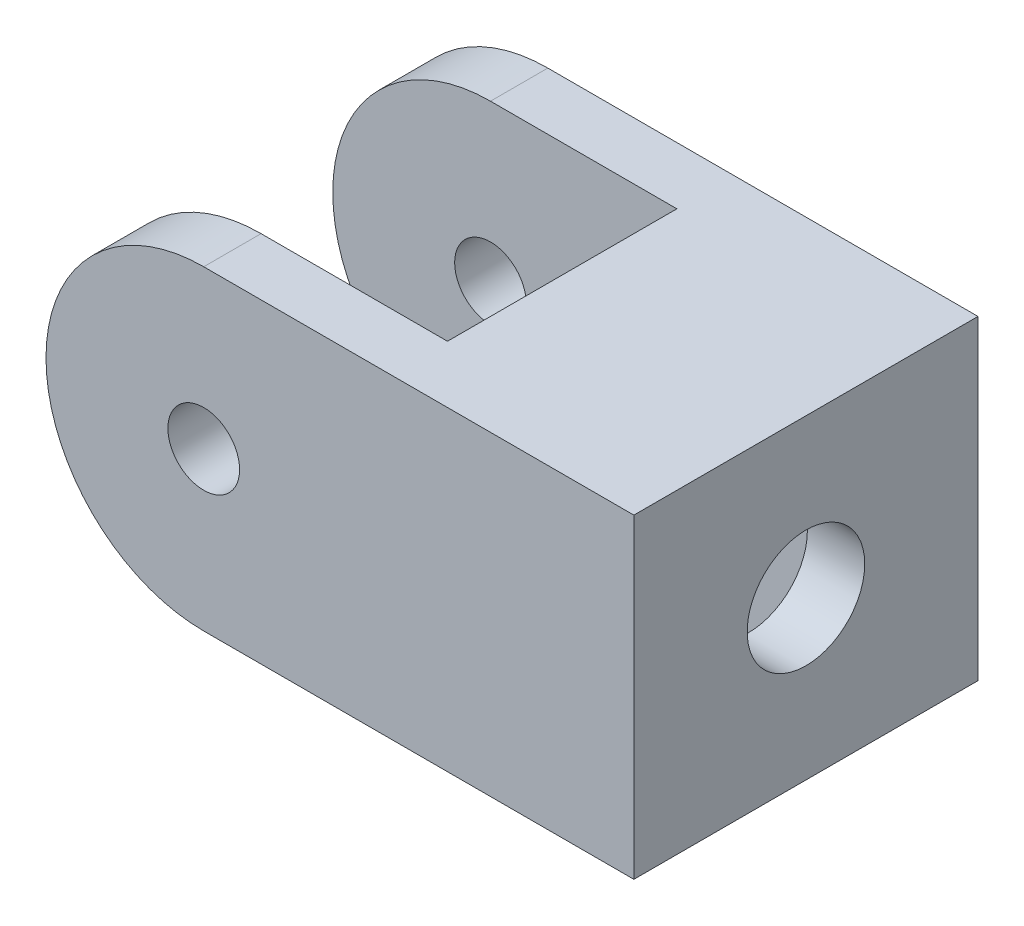
ISO-10303-21;
HEADER;
FILE_DESCRIPTION(('STEP AP214'),'2;1');
FILE_NAME('part.step','',(''),(''),'','','');
FILE_SCHEMA(('AUTOMOTIVE_DESIGN { 1 0 10303 214 1 1 1 1 }'));
ENDSEC;
DATA;
#1=APPLICATION_CONTEXT('core data for automotive mechanical design processes');
#2=APPLICATION_PROTOCOL_DEFINITION('international standard','automotive_design',2000,#1);
#3=PRODUCT_CONTEXT('',#1,'mechanical');
#4=PRODUCT('Part','Part','',(#3));
#5=PRODUCT_RELATED_PRODUCT_CATEGORY('part','',(#4));
#6=PRODUCT_DEFINITION_FORMATION('','',#4);
#7=PRODUCT_DEFINITION_CONTEXT('part definition',#1,'design');
#8=PRODUCT_DEFINITION('design','',#6,#7);
#9=PRODUCT_DEFINITION_SHAPE('','',#8);
#10=(LENGTH_UNIT() NAMED_UNIT(*) SI_UNIT(.MILLI.,.METRE.));
#11=(NAMED_UNIT(*) PLANE_ANGLE_UNIT() SI_UNIT($,.RADIAN.));
#12=(NAMED_UNIT(*) SI_UNIT($,.STERADIAN.) SOLID_ANGLE_UNIT());
#13=UNCERTAINTY_MEASURE_WITH_UNIT(LENGTH_MEASURE(1.E-05),#10,'distance_accuracy_value','');
#14=(GEOMETRIC_REPRESENTATION_CONTEXT(3) GLOBAL_UNCERTAINTY_ASSIGNED_CONTEXT((#13)) GLOBAL_UNIT_ASSIGNED_CONTEXT((#10,
#11,#12)) REPRESENTATION_CONTEXT('',''));
#15=CARTESIAN_POINT('',(0.,0.,0.));
#16=DIRECTION('',(0.,0.,1.));
#17=DIRECTION('',(1.,0.,0.));
#18=AXIS2_PLACEMENT_3D('',#15,#16,#17);
#19=CARTESIAN_POINT('',(30.,-11.,24.));
#20=DIRECTION('',(0.,1.,0.));
#21=DIRECTION('',(0.,0.,1.));
#22=AXIS2_PLACEMENT_3D('',#19,#20,#21);
#23=PLANE('',#22);
#24=DIRECTION('',(0.,0.,-1.));
#25=VECTOR('',#24,1.);
#26=CARTESIAN_POINT('',(13.,-11.,4.));
#27=LINE('',#26,#25);
#28=CARTESIAN_POINT('',(13.,-11.,20.));
#29=VERTEX_POINT('',#28);
#30=CARTESIAN_POINT('',(13.,-11.,4.));
#31=VERTEX_POINT('',#30);
#32=EDGE_CURVE('E163',#29,#31,#27,.T.);
#33=ORIENTED_EDGE('',*,*,#32,.T.);
#34=DIRECTION('',(-1.,0.,0.));
#35=VECTOR('',#34,1.);
#36=CARTESIAN_POINT('',(-11.,-11.,4.));
#37=LINE('',#36,#35);
#38=CARTESIAN_POINT('',(0.,-11.,4.));
#39=VERTEX_POINT('',#38);
#40=EDGE_CURVE('E167',#31,#39,#37,.T.);
#41=ORIENTED_EDGE('',*,*,#40,.T.);
#42=DIRECTION('',(0.,0.,-1.));
#43=VECTOR('',#42,1.);
#44=CARTESIAN_POINT('',(0.,-11.,24.));
#45=LINE('',#44,#43);
#46=CARTESIAN_POINT('',(0.,-11.,0.));
#47=VERTEX_POINT('',#46);
#48=EDGE_CURVE('E41',#39,#47,#45,.T.);
#49=ORIENTED_EDGE('',*,*,#48,.T.);
#50=DIRECTION('',(1.,0.,0.));
#51=VECTOR('',#50,1.);
#52=CARTESIAN_POINT('',(30.,-11.,0.));
#53=LINE('',#52,#51);
#54=CARTESIAN_POINT('',(30.,-11.,0.));
#55=VERTEX_POINT('',#54);
#56=EDGE_CURVE('E208',#47,#55,#53,.T.);
#57=ORIENTED_EDGE('',*,*,#56,.T.);
#58=DIRECTION('',(0.,0.,-1.));
#59=VECTOR('',#58,1.);
#60=CARTESIAN_POINT('',(30.,-11.,24.));
#61=LINE('',#60,#59);
#62=CARTESIAN_POINT('',(30.,-11.,24.));
#63=VERTEX_POINT('',#62);
#64=EDGE_CURVE('E220',#63,#55,#61,.T.);
#65=ORIENTED_EDGE('',*,*,#64,.F.);
#66=DIRECTION('',(1.,0.,0.));
#67=VECTOR('',#66,1.);
#68=CARTESIAN_POINT('',(30.,-11.,24.));
#69=LINE('',#68,#67);
#70=CARTESIAN_POINT('',(0.,-11.,24.));
#71=VERTEX_POINT('',#70);
#72=EDGE_CURVE('E198',#71,#63,#69,.T.);
#73=ORIENTED_EDGE('',*,*,#72,.F.);
#74=CARTESIAN_POINT('',(0.,-11.,20.));
#75=VERTEX_POINT('',#74);
#76=EDGE_CURVE('E11',#71,#75,#45,.T.);
#77=ORIENTED_EDGE('',*,*,#76,.T.);
#78=DIRECTION('',(1.,0.,0.));
#79=VECTOR('',#78,1.);
#80=CARTESIAN_POINT('',(-11.,-11.,20.));
#81=LINE('',#80,#79);
#82=EDGE_CURVE('E160',#75,#29,#81,.T.);
#83=ORIENTED_EDGE('',*,*,#82,.T.);
#84=EDGE_LOOP('',(#33,#41,#49,#57,#65,#73,#77,#83));
#85=FACE_BOUND('',#84,.T.);
#86=DIRECTION('',(0.,0.,-1.));
#87=VECTOR('',#86,1.);
#88=CARTESIAN_POINT('',(19.2,-11.,0.));
#89=LINE('',#88,#87);
#90=CARTESIAN_POINT('',(19.2,-11.,18.5));
#91=VERTEX_POINT('',#90);
#92=CARTESIAN_POINT('',(19.2,-11.,5.5));
#93=VERTEX_POINT('',#92);
#94=EDGE_CURVE('E140',#91,#93,#89,.T.);
#95=ORIENTED_EDGE('',*,*,#94,.F.);
#96=DIRECTION('',(1.,0.,0.));
#97=VECTOR('',#96,1.);
#98=CARTESIAN_POINT('',(19.2,-11.,18.5));
#99=LINE('',#98,#97);
#100=CARTESIAN_POINT('',(26.,-11.,18.5));
#101=VERTEX_POINT('',#100);
#102=EDGE_CURVE('E174',#91,#101,#99,.T.);
#103=ORIENTED_EDGE('',*,*,#102,.T.);
#104=DIRECTION('',(0.,0.,-1.));
#105=VECTOR('',#104,1.);
#106=CARTESIAN_POINT('',(26.,-11.,0.));
#107=LINE('',#106,#105);
#108=CARTESIAN_POINT('',(26.,-11.,5.5));
#109=VERTEX_POINT('',#108);
#110=EDGE_CURVE('E152',#101,#109,#107,.T.);
#111=ORIENTED_EDGE('',*,*,#110,.T.);
#112=DIRECTION('',(1.,0.,0.));
#113=VECTOR('',#112,1.);
#114=CARTESIAN_POINT('',(19.2,-11.,5.5));
#115=LINE('',#114,#113);
#116=EDGE_CURVE('E133',#93,#109,#115,.T.);
#117=ORIENTED_EDGE('',*,*,#116,.F.);
#118=EDGE_LOOP('',(#95,#103,#111,#117));
#119=FACE_BOUND('',#118,.T.);
#120=ADVANCED_FACE('F32',(#85,#119),#23,.F.);
#121=CARTESIAN_POINT('',(0.,0.,24.));
#122=DIRECTION('',(0.,0.,-1.));
#123=DIRECTION('',(-1.,0.,0.));
#124=AXIS2_PLACEMENT_3D('',#121,#122,#123);
#125=CYLINDRICAL_SURFACE('',#124,11.);
#126=CARTESIAN_POINT('',(0.,0.,4.));
#127=DIRECTION('',(0.,0.,-1.));
#128=DIRECTION('',(-1.,0.,0.));
#129=AXIS2_PLACEMENT_3D('',#126,#127,#128);
#130=CIRCLE('',#129,11.);
#131=CARTESIAN_POINT('',(0.,11.,4.));
#132=VERTEX_POINT('',#131);
#133=EDGE_CURVE('E186',#39,#132,#130,.T.);
#134=ORIENTED_EDGE('',*,*,#133,.T.);
#135=DIRECTION('',(0.,0.,-1.));
#136=VECTOR('',#135,1.);
#137=CARTESIAN_POINT('',(0.,11.,24.));
#138=LINE('',#137,#136);
#139=CARTESIAN_POINT('',(0.,11.,0.));
#140=VERTEX_POINT('',#139);
#141=EDGE_CURVE('E205',#132,#140,#138,.T.);
#142=ORIENTED_EDGE('',*,*,#141,.T.);
#143=CARTESIAN_POINT('',(0.,0.,0.));
#144=DIRECTION('',(0.,0.,1.));
#145=DIRECTION('',(1.,0.,0.));
#146=AXIS2_PLACEMENT_3D('',#143,#144,#145);
#147=CIRCLE('',#146,11.);
#148=EDGE_CURVE('E192',#140,#47,#147,.T.);
#149=ORIENTED_EDGE('',*,*,#148,.T.);
#150=ORIENTED_EDGE('',*,*,#48,.F.);
#151=EDGE_LOOP('',(#134,#142,#149,#150));
#152=FACE_BOUND('',#151,.T.);
#153=ADVANCED_FACE('F234',(#152),#125,.T.);
#154=CARTESIAN_POINT('',(0.,0.,24.));
#155=DIRECTION('',(0.,0.,-1.));
#156=DIRECTION('',(-1.,0.,0.));
#157=AXIS2_PLACEMENT_3D('',#154,#155,#156);
#158=CYLINDRICAL_SURFACE('',#157,2.5);
#159=CARTESIAN_POINT('',(0.,0.,4.));
#160=DIRECTION('',(0.,0.,-1.));
#161=DIRECTION('',(-1.,0.,0.));
#162=AXIS2_PLACEMENT_3D('',#159,#160,#161);
#163=CIRCLE('',#162,2.5);
#164=CARTESIAN_POINT('',(-2.5,0.,4.));
#165=VERTEX_POINT('',#164);
#166=EDGE_CURVE('E185',#165,#165,#163,.T.);
#167=ORIENTED_EDGE('',*,*,#166,.F.);
#168=EDGE_LOOP('',(#167));
#169=FACE_BOUND('',#168,.T.);
#170=CARTESIAN_POINT('',(0.,0.,0.));
#171=DIRECTION('',(0.,0.,1.));
#172=DIRECTION('',(1.,0.,0.));
#173=AXIS2_PLACEMENT_3D('',#170,#171,#172);
#174=CIRCLE('',#173,2.5);
#175=CARTESIAN_POINT('',(2.5,0.,0.));
#176=VERTEX_POINT('',#175);
#177=EDGE_CURVE('E188',#176,#176,#174,.T.);
#178=ORIENTED_EDGE('',*,*,#177,.F.);
#179=EDGE_LOOP('',(#178));
#180=FACE_BOUND('',#179,.T.);
#181=ADVANCED_FACE('F230',(#169,#180),#158,.F.);
#182=CARTESIAN_POINT('',(0.,0.,24.));
#183=DIRECTION('',(0.,0.,1.));
#184=DIRECTION('',(1.,0.,0.));
#185=AXIS2_PLACEMENT_3D('',#182,#183,#184);
#186=PLANE('',#185);
#187=CARTESIAN_POINT('',(0.,0.,24.));
#188=DIRECTION('',(0.,0.,1.));
#189=DIRECTION('',(1.,0.,0.));
#190=AXIS2_PLACEMENT_3D('',#187,#188,#189);
#191=CIRCLE('',#190,11.);
#192=CARTESIAN_POINT('',(0.,11.,24.));
#193=VERTEX_POINT('',#192);
#194=EDGE_CURVE('E195',#193,#71,#191,.T.);
#195=ORIENTED_EDGE('',*,*,#194,.T.);
#196=ORIENTED_EDGE('',*,*,#72,.T.);
#197=DIRECTION('',(0.,1.,0.));
#198=VECTOR('',#197,1.);
#199=CARTESIAN_POINT('',(30.,11.,24.));
#200=LINE('',#199,#198);
#201=CARTESIAN_POINT('',(30.,11.,24.));
#202=VERTEX_POINT('',#201);
#203=EDGE_CURVE('E201',#63,#202,#200,.T.);
#204=ORIENTED_EDGE('',*,*,#203,.T.);
#205=DIRECTION('',(-1.,0.,0.));
#206=VECTOR('',#205,1.);
#207=CARTESIAN_POINT('',(0.,11.,24.));
#208=LINE('',#207,#206);
#209=EDGE_CURVE('E203',#202,#193,#208,.T.);
#210=ORIENTED_EDGE('',*,*,#209,.T.);
#211=EDGE_LOOP('',(#195,#196,#204,#210));
#212=FACE_BOUND('',#211,.T.);
#213=CARTESIAN_POINT('',(0.,0.,24.));
#214=DIRECTION('',(0.,0.,1.));
#215=DIRECTION('',(1.,0.,0.));
#216=AXIS2_PLACEMENT_3D('',#213,#214,#215);
#217=CIRCLE('',#216,2.5);
#218=CARTESIAN_POINT('',(2.5,0.,24.));
#219=VERTEX_POINT('',#218);
#220=EDGE_CURVE('E189',#219,#219,#217,.T.);
#221=ORIENTED_EDGE('',*,*,#220,.F.);
#222=EDGE_LOOP('',(#221));
#223=FACE_BOUND('',#222,.T.);
#224=ADVANCED_FACE('F233',(#212,#223),#186,.T.);
#225=CARTESIAN_POINT('',(0.,0.,0.));
#226=DIRECTION('',(0.,0.,1.));
#227=DIRECTION('',(1.,0.,0.));
#228=AXIS2_PLACEMENT_3D('',#225,#226,#227);
#229=PLANE('',#228);
#230=ORIENTED_EDGE('',*,*,#148,.F.);
#231=DIRECTION('',(-1.,0.,0.));
#232=VECTOR('',#231,1.);
#233=CARTESIAN_POINT('',(0.,11.,0.));
#234=LINE('',#233,#232);
#235=CARTESIAN_POINT('',(30.,11.,0.));
#236=VERTEX_POINT('',#235);
#237=EDGE_CURVE('E199',#236,#140,#234,.T.);
#238=ORIENTED_EDGE('',*,*,#237,.F.);
#239=DIRECTION('',(0.,1.,0.));
#240=VECTOR('',#239,1.);
#241=CARTESIAN_POINT('',(30.,11.,0.));
#242=LINE('',#241,#240);
#243=EDGE_CURVE('E210',#55,#236,#242,.T.);
#244=ORIENTED_EDGE('',*,*,#243,.F.);
#245=ORIENTED_EDGE('',*,*,#56,.F.);
#246=EDGE_LOOP('',(#230,#238,#244,#245));
#247=FACE_BOUND('',#246,.T.);
#248=ORIENTED_EDGE('',*,*,#177,.T.);
#249=EDGE_LOOP('',(#248));
#250=FACE_BOUND('',#249,.T.);
#251=ADVANCED_FACE('F239',(#247,#250),#229,.F.);
#252=CARTESIAN_POINT('',(0.,11.,20.));
#253=VERTEX_POINT('',#252);
#254=EDGE_CURVE('E214',#193,#253,#138,.T.);
#255=ORIENTED_EDGE('',*,*,#254,.T.);
#256=CARTESIAN_POINT('',(0.,0.,20.));
#257=DIRECTION('',(0.,0.,1.));
#258=DIRECTION('',(1.,0.,0.));
#259=AXIS2_PLACEMENT_3D('',#256,#257,#258);
#260=CIRCLE('',#259,11.);
#261=EDGE_CURVE('E57',#253,#75,#260,.T.);
#262=ORIENTED_EDGE('',*,*,#261,.T.);
#263=ORIENTED_EDGE('',*,*,#76,.F.);
#264=ORIENTED_EDGE('',*,*,#194,.F.);
#265=EDGE_LOOP('',(#255,#262,#263,#264));
#266=FACE_BOUND('',#265,.T.);
#267=ADVANCED_FACE('F34',(#266),#125,.T.);
#268=CARTESIAN_POINT('',(30.,11.,24.));
#269=DIRECTION('',(-1.,0.,0.));
#270=DIRECTION('',(0.,0.,1.));
#271=AXIS2_PLACEMENT_3D('',#268,#269,#270);
#272=PLANE('',#271);
#273=CARTESIAN_POINT('',(30.,0.,12.));
#274=DIRECTION('',(1.,0.,0.));
#275=DIRECTION('',(0.,0.,-1.));
#276=AXIS2_PLACEMENT_3D('',#273,#274,#275);
#277=CIRCLE('',#276,4.1);
#278=CARTESIAN_POINT('',(30.,0.,7.9));
#279=VERTEX_POINT('',#278);
#280=EDGE_CURVE('E337',#279,#279,#277,.T.);
#281=ORIENTED_EDGE('',*,*,#280,.F.);
#282=EDGE_LOOP('',(#281));
#283=FACE_BOUND('',#282,.T.);
#284=ORIENTED_EDGE('',*,*,#243,.T.);
#285=DIRECTION('',(0.,0.,-1.));
#286=VECTOR('',#285,1.);
#287=CARTESIAN_POINT('',(30.,11.,24.));
#288=LINE('',#287,#286);
#289=EDGE_CURVE('E217',#202,#236,#288,.T.);
#290=ORIENTED_EDGE('',*,*,#289,.F.);
#291=ORIENTED_EDGE('',*,*,#203,.F.);
#292=ORIENTED_EDGE('',*,*,#64,.T.);
#293=EDGE_LOOP('',(#284,#290,#291,#292));
#294=FACE_BOUND('',#293,.T.);
#295=ADVANCED_FACE('F247',(#283,#294),#272,.F.);
#296=CARTESIAN_POINT('',(0.,11.,24.));
#297=DIRECTION('',(0.,-1.,0.));
#298=DIRECTION('',(0.,0.,-1.));
#299=AXIS2_PLACEMENT_3D('',#296,#297,#298);
#300=PLANE('',#299);
#301=ORIENTED_EDGE('',*,*,#141,.F.);
#302=DIRECTION('',(-1.,0.,0.));
#303=VECTOR('',#302,1.);
#304=CARTESIAN_POINT('',(-11.,11.,4.));
#305=LINE('',#304,#303);
#306=CARTESIAN_POINT('',(13.,11.,4.));
#307=VERTEX_POINT('',#306);
#308=EDGE_CURVE('E164',#307,#132,#305,.T.);
#309=ORIENTED_EDGE('',*,*,#308,.F.);
#310=DIRECTION('',(0.,0.,-1.));
#311=VECTOR('',#310,1.);
#312=CARTESIAN_POINT('',(13.,11.,4.));
#313=LINE('',#312,#311);
#314=CARTESIAN_POINT('',(13.,11.,20.));
#315=VERTEX_POINT('',#314);
#316=EDGE_CURVE('E173',#315,#307,#313,.T.);
#317=ORIENTED_EDGE('',*,*,#316,.F.);
#318=DIRECTION('',(1.,0.,0.));
#319=VECTOR('',#318,1.);
#320=CARTESIAN_POINT('',(-11.,11.,20.));
#321=LINE('',#320,#319);
#322=EDGE_CURVE('E171',#253,#315,#321,.T.);
#323=ORIENTED_EDGE('',*,*,#322,.F.);
#324=ORIENTED_EDGE('',*,*,#254,.F.);
#325=ORIENTED_EDGE('',*,*,#209,.F.);
#326=ORIENTED_EDGE('',*,*,#289,.T.);
#327=ORIENTED_EDGE('',*,*,#237,.T.);
#328=EDGE_LOOP('',(#301,#309,#317,#323,#324,#325,#326,#327));
#329=FACE_BOUND('',#328,.T.);
#330=ADVANCED_FACE('F261',(#329),#300,.F.);
#331=CARTESIAN_POINT('',(0.,0.,20.));
#332=DIRECTION('',(0.,0.,1.));
#333=DIRECTION('',(1.,0.,0.));
#334=AXIS2_PLACEMENT_3D('',#331,#332,#333);
#335=CIRCLE('',#334,2.5);
#336=CARTESIAN_POINT('',(2.5,0.,20.));
#337=VERTEX_POINT('',#336);
#338=EDGE_CURVE('E181',#337,#337,#335,.T.);
#339=ORIENTED_EDGE('',*,*,#338,.F.);
#340=EDGE_LOOP('',(#339));
#341=FACE_BOUND('',#340,.T.);
#342=ORIENTED_EDGE('',*,*,#220,.T.);
#343=EDGE_LOOP('',(#342));
#344=FACE_BOUND('',#343,.T.);
#345=ADVANCED_FACE('F236',(#341,#344),#158,.F.);
#346=CARTESIAN_POINT('',(-11.,-11.,4.));
#347=DIRECTION('',(0.,0.,-1.));
#348=DIRECTION('',(-1.,0.,0.));
#349=AXIS2_PLACEMENT_3D('',#346,#347,#348);
#350=PLANE('',#349);
#351=ORIENTED_EDGE('',*,*,#166,.T.);
#352=EDGE_LOOP('',(#351));
#353=FACE_BOUND('',#352,.T.);
#354=ORIENTED_EDGE('',*,*,#133,.F.);
#355=ORIENTED_EDGE('',*,*,#40,.F.);
#356=DIRECTION('',(0.,1.,0.));
#357=VECTOR('',#356,1.);
#358=CARTESIAN_POINT('',(13.,-11.,4.));
#359=LINE('',#358,#357);
#360=EDGE_CURVE('E179',#31,#307,#359,.T.);
#361=ORIENTED_EDGE('',*,*,#360,.T.);
#362=ORIENTED_EDGE('',*,*,#308,.T.);
#363=EDGE_LOOP('',(#354,#355,#361,#362));
#364=FACE_BOUND('',#363,.T.);
#365=ADVANCED_FACE('F227',(#353,#364),#350,.F.);
#366=CARTESIAN_POINT('',(-11.,-11.,20.));
#367=DIRECTION('',(0.,0.,1.));
#368=DIRECTION('',(1.,0.,0.));
#369=AXIS2_PLACEMENT_3D('',#366,#367,#368);
#370=PLANE('',#369);
#371=ORIENTED_EDGE('',*,*,#338,.T.);
#372=EDGE_LOOP('',(#371));
#373=FACE_BOUND('',#372,.T.);
#374=ORIENTED_EDGE('',*,*,#322,.T.);
#375=DIRECTION('',(0.,1.,0.));
#376=VECTOR('',#375,1.);
#377=CARTESIAN_POINT('',(13.,-11.,20.));
#378=LINE('',#377,#376);
#379=EDGE_CURVE('E170',#29,#315,#378,.T.);
#380=ORIENTED_EDGE('',*,*,#379,.F.);
#381=ORIENTED_EDGE('',*,*,#82,.F.);
#382=ORIENTED_EDGE('',*,*,#261,.F.);
#383=EDGE_LOOP('',(#374,#380,#381,#382));
#384=FACE_BOUND('',#383,.T.);
#385=ADVANCED_FACE('F289',(#373,#384),#370,.F.);
#386=CARTESIAN_POINT('',(13.,-11.,4.));
#387=DIRECTION('',(1.,0.,0.));
#388=DIRECTION('',(0.,0.,-1.));
#389=AXIS2_PLACEMENT_3D('',#386,#387,#388);
#390=PLANE('',#389);
#391=CARTESIAN_POINT('',(13.,0.,12.));
#392=DIRECTION('',(1.,0.,0.));
#393=DIRECTION('',(0.,0.,-1.));
#394=AXIS2_PLACEMENT_3D('',#391,#392,#393);
#395=CIRCLE('',#394,4.1);
#396=CARTESIAN_POINT('',(13.,0.,7.9));
#397=VERTEX_POINT('',#396);
#398=EDGE_CURVE('E336',#397,#397,#395,.F.);
#399=ORIENTED_EDGE('',*,*,#398,.F.);
#400=EDGE_LOOP('',(#399));
#401=FACE_BOUND('',#400,.T.);
#402=ORIENTED_EDGE('',*,*,#316,.T.);
#403=ORIENTED_EDGE('',*,*,#360,.F.);
#404=ORIENTED_EDGE('',*,*,#32,.F.);
#405=ORIENTED_EDGE('',*,*,#379,.T.);
#406=EDGE_LOOP('',(#402,#403,#404,#405));
#407=FACE_BOUND('',#406,.T.);
#408=ADVANCED_FACE('F277',(#401,#407),#390,.F.);
#409=CARTESIAN_POINT('',(19.2,0.,18.5));
#410=DIRECTION('',(0.,0.,1.));
#411=DIRECTION('',(1.,0.,0.));
#412=AXIS2_PLACEMENT_3D('',#409,#410,#411);
#413=PLANE('',#412);
#414=DIRECTION('',(0.,-1.,0.));
#415=VECTOR('',#414,1.);
#416=CARTESIAN_POINT('',(26.,0.,18.5));
#417=LINE('',#416,#415);
#418=CARTESIAN_POINT('',(26.,3.75277674973257,18.5));
#419=VERTEX_POINT('',#418);
#420=EDGE_CURVE('E150',#419,#101,#417,.T.);
#421=ORIENTED_EDGE('',*,*,#420,.T.);
#422=ORIENTED_EDGE('',*,*,#102,.F.);
#423=DIRECTION('',(0.,-1.,0.));
#424=VECTOR('',#423,1.);
#425=CARTESIAN_POINT('',(19.2,0.,18.5));
#426=LINE('',#425,#424);
#427=CARTESIAN_POINT('',(19.2,3.75277674973257,18.5));
#428=VERTEX_POINT('',#427);
#429=EDGE_CURVE('E147',#428,#91,#426,.T.);
#430=ORIENTED_EDGE('',*,*,#429,.F.);
#431=DIRECTION('',(1.,0.,0.));
#432=VECTOR('',#431,1.);
#433=CARTESIAN_POINT('',(19.2,3.75277674973257,18.5));
#434=LINE('',#433,#432);
#435=EDGE_CURVE('E357',#428,#419,#434,.T.);
#436=ORIENTED_EDGE('',*,*,#435,.T.);
#437=EDGE_LOOP('',(#421,#422,#430,#436));
#438=FACE_BOUND('',#437,.T.);
#439=ADVANCED_FACE('F297',(#438),#413,.F.);
#440=CARTESIAN_POINT('',(19.2,10.8253175473055,6.25));
#441=DIRECTION('',(0.,0.866025403784439,0.5));
#442=DIRECTION('',(0.,-0.5,0.866025403784439));
#443=AXIS2_PLACEMENT_3D('',#440,#441,#442);
#444=PLANE('',#443);
#445=DIRECTION('',(0.,-0.5,0.866025403784439));
#446=VECTOR('',#445,1.);
#447=CARTESIAN_POINT('',(26.,10.8253175473055,6.25));
#448=LINE('',#447,#446);
#449=CARTESIAN_POINT('',(26.,7.50555349946514,12.));
#450=VERTEX_POINT('',#449);
#451=EDGE_CURVE('E351',#450,#419,#448,.T.);
#452=ORIENTED_EDGE('',*,*,#451,.T.);
#453=ORIENTED_EDGE('',*,*,#435,.F.);
#454=DIRECTION('',(0.,-0.5,0.866025403784439));
#455=VECTOR('',#454,1.);
#456=CARTESIAN_POINT('',(19.2,10.8253175473055,6.25));
#457=LINE('',#456,#455);
#458=CARTESIAN_POINT('',(19.2,7.50555349946514,12.));
#459=VERTEX_POINT('',#458);
#460=EDGE_CURVE('E156',#459,#428,#457,.T.);
#461=ORIENTED_EDGE('',*,*,#460,.F.);
#462=DIRECTION('',(1.,0.,0.));
#463=VECTOR('',#462,1.);
#464=CARTESIAN_POINT('',(19.2,7.50555349946514,12.));
#465=LINE('',#464,#463);
#466=EDGE_CURVE('E154',#459,#450,#465,.T.);
#467=ORIENTED_EDGE('',*,*,#466,.T.);
#468=EDGE_LOOP('',(#452,#453,#461,#467));
#469=FACE_BOUND('',#468,.T.);
#470=ADVANCED_FACE('F307',(#469),#444,.F.);
#471=CARTESIAN_POINT('',(19.2,0.43301270189222,-0.250000000000001));
#472=DIRECTION('',(0.,0.866025403784439,-0.5));
#473=DIRECTION('',(0.,0.5,0.866025403784438));
#474=AXIS2_PLACEMENT_3D('',#471,#472,#473);
#475=PLANE('',#474);
#476=DIRECTION('',(0.,0.5,0.866025403784439));
#477=VECTOR('',#476,1.);
#478=CARTESIAN_POINT('',(26.,0.43301270189222,-0.250000000000001));
#479=LINE('',#478,#477);
#480=CARTESIAN_POINT('',(26.,3.75277674973257,5.5));
#481=VERTEX_POINT('',#480);
#482=EDGE_CURVE('E348',#481,#450,#479,.T.);
#483=ORIENTED_EDGE('',*,*,#482,.T.);
#484=ORIENTED_EDGE('',*,*,#466,.F.);
#485=DIRECTION('',(0.,0.5,0.866025403784439));
#486=VECTOR('',#485,1.);
#487=CARTESIAN_POINT('',(19.2,0.43301270189222,-0.250000000000001));
#488=LINE('',#487,#486);
#489=CARTESIAN_POINT('',(19.2,3.75277674973257,5.5));
#490=VERTEX_POINT('',#489);
#491=EDGE_CURVE('E139',#490,#459,#488,.T.);
#492=ORIENTED_EDGE('',*,*,#491,.F.);
#493=DIRECTION('',(1.,0.,0.));
#494=VECTOR('',#493,1.);
#495=CARTESIAN_POINT('',(19.2,3.75277674973257,5.5));
#496=LINE('',#495,#494);
#497=EDGE_CURVE('E135',#490,#481,#496,.T.);
#498=ORIENTED_EDGE('',*,*,#497,.T.);
#499=EDGE_LOOP('',(#483,#484,#492,#498));
#500=FACE_BOUND('',#499,.T.);
#501=ADVANCED_FACE('F304',(#500),#475,.F.);
#502=CARTESIAN_POINT('',(19.2,0.,5.5));
#503=DIRECTION('',(0.,0.,-1.));
#504=DIRECTION('',(0.,1.,0.));
#505=AXIS2_PLACEMENT_3D('',#502,#503,#504);
#506=PLANE('',#505);
#507=DIRECTION('',(0.,1.,0.));
#508=VECTOR('',#507,1.);
#509=CARTESIAN_POINT('',(26.,0.,5.5));
#510=LINE('',#509,#508);
#511=EDGE_CURVE('E49',#109,#481,#510,.T.);
#512=ORIENTED_EDGE('',*,*,#511,.T.);
#513=ORIENTED_EDGE('',*,*,#497,.F.);
#514=DIRECTION('',(0.,1.,0.));
#515=VECTOR('',#514,1.);
#516=CARTESIAN_POINT('',(19.2,0.,5.5));
#517=LINE('',#516,#515);
#518=EDGE_CURVE('E129',#93,#490,#517,.T.);
#519=ORIENTED_EDGE('',*,*,#518,.F.);
#520=ORIENTED_EDGE('',*,*,#116,.T.);
#521=EDGE_LOOP('',(#512,#513,#519,#520));
#522=FACE_BOUND('',#521,.T.);
#523=ADVANCED_FACE('F131',(#522),#506,.F.);
#524=CARTESIAN_POINT('',(19.2,0.,0.));
#525=DIRECTION('',(1.,0.,0.));
#526=DIRECTION('',(0.,0.,-1.));
#527=AXIS2_PLACEMENT_3D('',#524,#525,#526);
#528=PLANE('',#527);
#529=CARTESIAN_POINT('',(19.2,0.,12.));
#530=DIRECTION('',(1.,0.,0.));
#531=DIRECTION('',(0.,0.,-1.));
#532=AXIS2_PLACEMENT_3D('',#529,#530,#531);
#533=CIRCLE('',#532,4.1);
#534=CARTESIAN_POINT('',(19.2,0.,7.9));
#535=VERTEX_POINT('',#534);
#536=EDGE_CURVE('E333',#535,#535,#533,.T.);
#537=ORIENTED_EDGE('',*,*,#536,.F.);
#538=EDGE_LOOP('',(#537));
#539=FACE_BOUND('',#538,.T.);
#540=ORIENTED_EDGE('',*,*,#94,.T.);
#541=ORIENTED_EDGE('',*,*,#518,.T.);
#542=ORIENTED_EDGE('',*,*,#491,.T.);
#543=ORIENTED_EDGE('',*,*,#460,.T.);
#544=ORIENTED_EDGE('',*,*,#429,.T.);
#545=EDGE_LOOP('',(#540,#541,#542,#543,#544));
#546=FACE_BOUND('',#545,.T.);
#547=ADVANCED_FACE('F144',(#539,#546),#528,.T.);
#548=CARTESIAN_POINT('',(26.,0.,0.));
#549=DIRECTION('',(1.,0.,0.));
#550=DIRECTION('',(0.,0.,-1.));
#551=AXIS2_PLACEMENT_3D('',#548,#549,#550);
#552=PLANE('',#551);
#553=CARTESIAN_POINT('',(26.,0.,12.));
#554=DIRECTION('',(1.,0.,0.));
#555=DIRECTION('',(0.,0.,-1.));
#556=AXIS2_PLACEMENT_3D('',#553,#554,#555);
#557=CIRCLE('',#556,4.1);
#558=CARTESIAN_POINT('',(26.,0.,7.9));
#559=VERTEX_POINT('',#558);
#560=EDGE_CURVE('E36',#559,#559,#557,.T.);
#561=ORIENTED_EDGE('',*,*,#560,.T.);
#562=EDGE_LOOP('',(#561));
#563=FACE_BOUND('',#562,.T.);
#564=ORIENTED_EDGE('',*,*,#110,.F.);
#565=ORIENTED_EDGE('',*,*,#420,.F.);
#566=ORIENTED_EDGE('',*,*,#451,.F.);
#567=ORIENTED_EDGE('',*,*,#482,.F.);
#568=ORIENTED_EDGE('',*,*,#511,.F.);
#569=EDGE_LOOP('',(#564,#565,#566,#567,#568));
#570=FACE_BOUND('',#569,.T.);
#571=ADVANCED_FACE('F315',(#563,#570),#552,.F.);
#572=CARTESIAN_POINT('',(1.40344878854062,0.,12.));
#573=DIRECTION('',(1.,0.,0.));
#574=DIRECTION('',(0.,0.,-1.));
#575=AXIS2_PLACEMENT_3D('',#572,#573,#574);
#576=CYLINDRICAL_SURFACE('',#575,4.1);
#577=ORIENTED_EDGE('',*,*,#280,.T.);
#578=EDGE_LOOP('',(#577));
#579=FACE_BOUND('',#578,.T.);
#580=ORIENTED_EDGE('',*,*,#560,.F.);
#581=EDGE_LOOP('',(#580));
#582=FACE_BOUND('',#581,.T.);
#583=ADVANCED_FACE('F318',(#579,#582),#576,.F.);
#584=ORIENTED_EDGE('',*,*,#536,.T.);
#585=EDGE_LOOP('',(#584));
#586=FACE_BOUND('',#585,.T.);
#587=ORIENTED_EDGE('',*,*,#398,.T.);
#588=EDGE_LOOP('',(#587));
#589=FACE_BOUND('',#588,.T.);
#590=ADVANCED_FACE('F323',(#586,#589),#576,.F.);
#591=CLOSED_SHELL('',(#120,#153,#181,#224,#251,#267,#295,#330,#345,#365,#385,#408,#439,#470,
#501,#523,#547,#571,#583,#590));
#592=MANIFOLD_SOLID_BREP('B2',#591);
#593=ADVANCED_BREP_SHAPE_REPRESENTATION('',(#18,#592),#14);
#594=SHAPE_DEFINITION_REPRESENTATION(#9,#593);
ENDSEC;
END-ISO-10303-21;
